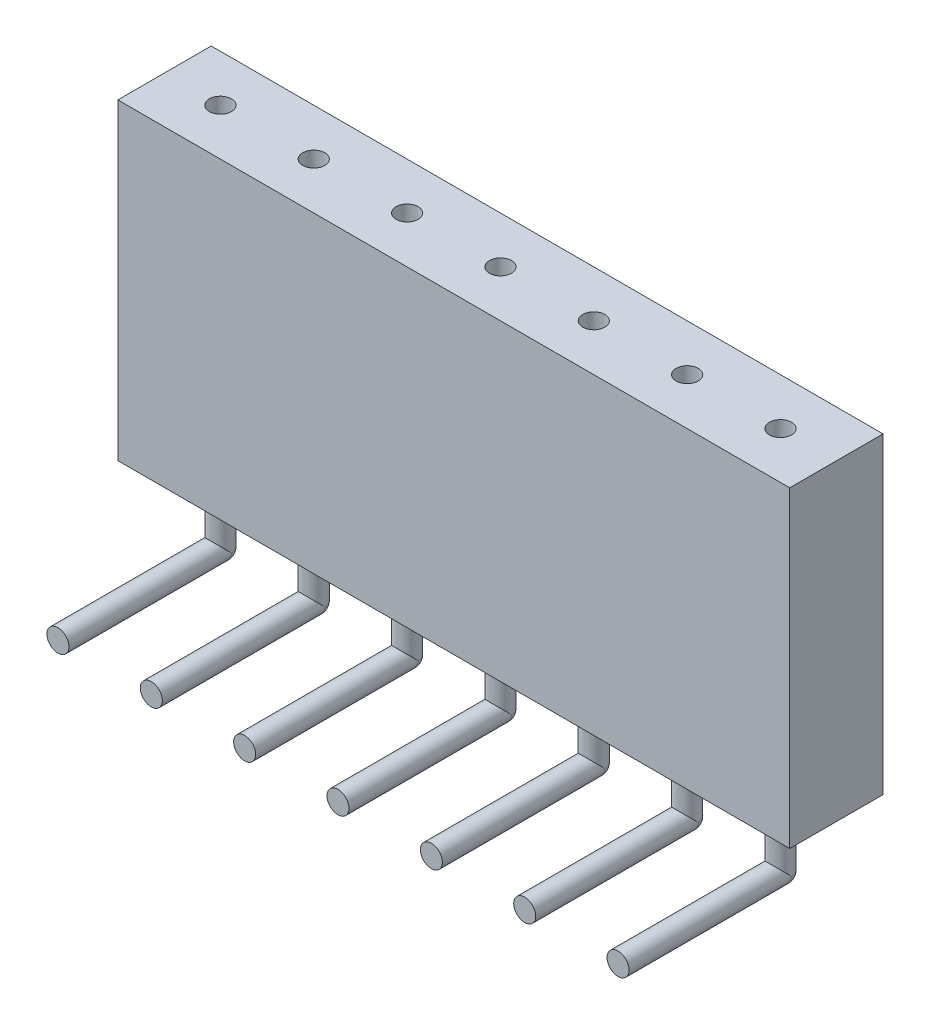
ISO-10303-21;
HEADER;
FILE_DESCRIPTION(('STEP AP214'),'2;1');
FILE_NAME('part.step','',(''),(''),'','','');
FILE_SCHEMA(('AUTOMOTIVE_DESIGN { 1 0 10303 214 1 1 1 1 }'));
ENDSEC;
DATA;
#1=APPLICATION_CONTEXT('core data for automotive mechanical design processes');
#2=APPLICATION_PROTOCOL_DEFINITION('international standard','automotive_design',2000,#1);
#3=PRODUCT_CONTEXT('',#1,'mechanical');
#4=PRODUCT('Part','Part','',(#3));
#5=PRODUCT_RELATED_PRODUCT_CATEGORY('part','',(#4));
#6=PRODUCT_DEFINITION_FORMATION('','',#4);
#7=PRODUCT_DEFINITION_CONTEXT('part definition',#1,'design');
#8=PRODUCT_DEFINITION('design','',#6,#7);
#9=PRODUCT_DEFINITION_SHAPE('','',#8);
#10=(LENGTH_UNIT() NAMED_UNIT(*) SI_UNIT(.MILLI.,.METRE.));
#11=(NAMED_UNIT(*) PLANE_ANGLE_UNIT() SI_UNIT($,.RADIAN.));
#12=(NAMED_UNIT(*) SI_UNIT($,.STERADIAN.) SOLID_ANGLE_UNIT());
#13=UNCERTAINTY_MEASURE_WITH_UNIT(LENGTH_MEASURE(1.E-05),#10,'distance_accuracy_value','');
#14=(GEOMETRIC_REPRESENTATION_CONTEXT(3) GLOBAL_UNCERTAINTY_ASSIGNED_CONTEXT((#13)) GLOBAL_UNIT_ASSIGNED_CONTEXT((#10,
#11,#12)) REPRESENTATION_CONTEXT('',''));
#15=CARTESIAN_POINT('',(0.,0.,0.));
#16=DIRECTION('',(0.,0.,1.));
#17=DIRECTION('',(1.,0.,0.));
#18=AXIS2_PLACEMENT_3D('',#15,#16,#17);
#19=CARTESIAN_POINT('',(7.61999999999998,-1.9,-0.3));
#20=DIRECTION('',(0.,0.,1.));
#21=DIRECTION('',(1.,0.,0.));
#22=AXIS2_PLACEMENT_3D('',#19,#20,#21);
#23=CYLINDRICAL_SURFACE('',#22,0.3);
#24=CARTESIAN_POINT('',(7.61999999999998,-1.9,0.));
#25=DIRECTION('',(0.,0.,1.));
#26=DIRECTION('',(1.,0.,0.));
#27=AXIS2_PLACEMENT_3D('',#24,#25,#26);
#28=CIRCLE('',#27,0.3);
#29=CARTESIAN_POINT('',(7.91999999999998,-1.9,0.));
#30=VERTEX_POINT('',#29);
#31=EDGE_CURVE('E11',#30,#30,#28,.T.);
#32=ORIENTED_EDGE('',*,*,#31,.T.);
#33=EDGE_LOOP('',(#32));
#34=FACE_BOUND('',#33,.T.);
#35=CARTESIAN_POINT('',(7.61999999999998,-1.9,4.42));
#36=DIRECTION('',(0.,0.,1.));
#37=DIRECTION('',(1.,0.,0.));
#38=AXIS2_PLACEMENT_3D('',#35,#36,#37);
#39=CIRCLE('',#38,0.3);
#40=CARTESIAN_POINT('',(7.91999999999998,-1.9,4.42));
#41=VERTEX_POINT('',#40);
#42=EDGE_CURVE('E49',#41,#41,#39,.T.);
#43=ORIENTED_EDGE('',*,*,#42,.F.);
#44=EDGE_LOOP('',(#43));
#45=FACE_BOUND('',#44,.T.);
#46=ADVANCED_FACE('F42',(#34,#45),#23,.T.);
#47=CARTESIAN_POINT('',(7.61999999999998,-1.9,4.42));
#48=DIRECTION('',(0.,0.,1.));
#49=DIRECTION('',(1.,0.,0.));
#50=AXIS2_PLACEMENT_3D('',#47,#48,#49);
#51=PLANE('',#50);
#52=ORIENTED_EDGE('',*,*,#42,.T.);
#53=EDGE_LOOP('',(#52));
#54=FACE_BOUND('',#53,.T.);
#55=ADVANCED_FACE('F55',(#54),#51,.T.);
#56=CARTESIAN_POINT('',(7.61999999999998,-1.9,0.));
#57=DIRECTION('',(0.,0.,1.));
#58=DIRECTION('',(1.,0.,0.));
#59=AXIS2_PLACEMENT_3D('',#56,#57,#58);
#60=SPHERICAL_SURFACE('',#59,0.3);
#61=ORIENTED_EDGE('',*,*,#31,.F.);
#62=EDGE_LOOP('',(#61));
#63=FACE_BOUND('',#62,.T.);
#64=ADVANCED_FACE('F44',(#63),#60,.T.);
#65=CLOSED_SHELL('',(#46,#55,#64));
#66=MANIFOLD_SOLID_BREP('B2',#65);
#67=CARTESIAN_POINT('',(5.07999999999998,-1.9,-0.3));
#68=DIRECTION('',(0.,0.,1.));
#69=DIRECTION('',(1.,0.,0.));
#70=AXIS2_PLACEMENT_3D('',#67,#68,#69);
#71=CYLINDRICAL_SURFACE('',#70,0.3);
#72=CARTESIAN_POINT('',(5.07999999999998,-1.9,0.));
#73=DIRECTION('',(0.,0.,1.));
#74=DIRECTION('',(1.,0.,0.));
#75=AXIS2_PLACEMENT_3D('',#72,#73,#74);
#76=CIRCLE('',#75,0.3);
#77=CARTESIAN_POINT('',(5.37999999999998,-1.9,0.));
#78=VERTEX_POINT('',#77);
#79=EDGE_CURVE('E41',#78,#78,#76,.T.);
#80=ORIENTED_EDGE('',*,*,#79,.T.);
#81=EDGE_LOOP('',(#80));
#82=FACE_BOUND('',#81,.T.);
#83=CARTESIAN_POINT('',(5.07999999999998,-1.9,4.42));
#84=DIRECTION('',(0.,0.,1.));
#85=DIRECTION('',(1.,0.,0.));
#86=AXIS2_PLACEMENT_3D('',#83,#84,#85);
#87=CIRCLE('',#86,0.3);
#88=CARTESIAN_POINT('',(5.37999999999998,-1.9,4.42));
#89=VERTEX_POINT('',#88);
#90=EDGE_CURVE('E98',#89,#89,#87,.T.);
#91=ORIENTED_EDGE('',*,*,#90,.F.);
#92=EDGE_LOOP('',(#91));
#93=FACE_BOUND('',#92,.T.);
#94=ADVANCED_FACE('F91',(#82,#93),#71,.T.);
#95=CARTESIAN_POINT('',(5.07999999999998,-1.9,4.42));
#96=DIRECTION('',(0.,0.,1.));
#97=DIRECTION('',(1.,0.,0.));
#98=AXIS2_PLACEMENT_3D('',#95,#96,#97);
#99=PLANE('',#98);
#100=ORIENTED_EDGE('',*,*,#90,.T.);
#101=EDGE_LOOP('',(#100));
#102=FACE_BOUND('',#101,.T.);
#103=ADVANCED_FACE('F104',(#102),#99,.T.);
#104=CARTESIAN_POINT('',(5.07999999999998,-1.9,0.));
#105=DIRECTION('',(0.,0.,1.));
#106=DIRECTION('',(1.,0.,0.));
#107=AXIS2_PLACEMENT_3D('',#104,#105,#106);
#108=SPHERICAL_SURFACE('',#107,0.3);
#109=ORIENTED_EDGE('',*,*,#79,.F.);
#110=EDGE_LOOP('',(#109));
#111=FACE_BOUND('',#110,.T.);
#112=ADVANCED_FACE('F93',(#111),#108,.T.);
#113=CLOSED_SHELL('',(#94,#103,#112));
#114=MANIFOLD_SOLID_BREP('B6',#113);
#115=CARTESIAN_POINT('',(2.53999999999998,-1.9,-0.3));
#116=DIRECTION('',(0.,0.,1.));
#117=DIRECTION('',(1.,0.,0.));
#118=AXIS2_PLACEMENT_3D('',#115,#116,#117);
#119=CYLINDRICAL_SURFACE('',#118,0.3);
#120=CARTESIAN_POINT('',(2.53999999999998,-1.9,0.));
#121=DIRECTION('',(0.,0.,1.));
#122=DIRECTION('',(1.,0.,0.));
#123=AXIS2_PLACEMENT_3D('',#120,#121,#122);
#124=CIRCLE('',#123,0.3);
#125=CARTESIAN_POINT('',(2.83999999999998,-1.9,0.));
#126=VERTEX_POINT('',#125);
#127=EDGE_CURVE('E90',#126,#126,#124,.T.);
#128=ORIENTED_EDGE('',*,*,#127,.T.);
#129=EDGE_LOOP('',(#128));
#130=FACE_BOUND('',#129,.T.);
#131=CARTESIAN_POINT('',(2.53999999999998,-1.9,4.42));
#132=DIRECTION('',(0.,0.,1.));
#133=DIRECTION('',(1.,0.,0.));
#134=AXIS2_PLACEMENT_3D('',#131,#132,#133);
#135=CIRCLE('',#134,0.3);
#136=CARTESIAN_POINT('',(2.83999999999998,-1.9,4.42));
#137=VERTEX_POINT('',#136);
#138=EDGE_CURVE('E147',#137,#137,#135,.T.);
#139=ORIENTED_EDGE('',*,*,#138,.F.);
#140=EDGE_LOOP('',(#139));
#141=FACE_BOUND('',#140,.T.);
#142=ADVANCED_FACE('F140',(#130,#141),#119,.T.);
#143=CARTESIAN_POINT('',(2.53999999999998,-1.9,4.42));
#144=DIRECTION('',(0.,0.,1.));
#145=DIRECTION('',(1.,0.,0.));
#146=AXIS2_PLACEMENT_3D('',#143,#144,#145);
#147=PLANE('',#146);
#148=ORIENTED_EDGE('',*,*,#138,.T.);
#149=EDGE_LOOP('',(#148));
#150=FACE_BOUND('',#149,.T.);
#151=ADVANCED_FACE('F153',(#150),#147,.T.);
#152=CARTESIAN_POINT('',(2.53999999999998,-1.9,0.));
#153=DIRECTION('',(0.,0.,1.));
#154=DIRECTION('',(1.,0.,0.));
#155=AXIS2_PLACEMENT_3D('',#152,#153,#154);
#156=SPHERICAL_SURFACE('',#155,0.3);
#157=ORIENTED_EDGE('',*,*,#127,.F.);
#158=EDGE_LOOP('',(#157));
#159=FACE_BOUND('',#158,.T.);
#160=ADVANCED_FACE('F142',(#159),#156,.T.);
#161=CLOSED_SHELL('',(#142,#151,#160));
#162=MANIFOLD_SOLID_BREP('B36',#161);
#163=CARTESIAN_POINT('',(0.,-1.9,-0.3));
#164=DIRECTION('',(0.,0.,1.));
#165=DIRECTION('',(1.,0.,0.));
#166=AXIS2_PLACEMENT_3D('',#163,#164,#165);
#167=CYLINDRICAL_SURFACE('',#166,0.3);
#168=CARTESIAN_POINT('',(0.,-1.9,0.));
#169=DIRECTION('',(0.,0.,1.));
#170=DIRECTION('',(1.,0.,0.));
#171=AXIS2_PLACEMENT_3D('',#168,#169,#170);
#172=CIRCLE('',#171,0.3);
#173=CARTESIAN_POINT('',(0.299999999999976,-1.9,0.));
#174=VERTEX_POINT('',#173);
#175=EDGE_CURVE('E139',#174,#174,#172,.T.);
#176=ORIENTED_EDGE('',*,*,#175,.T.);
#177=EDGE_LOOP('',(#176));
#178=FACE_BOUND('',#177,.T.);
#179=CARTESIAN_POINT('',(0.,-1.9,4.42));
#180=DIRECTION('',(0.,0.,1.));
#181=DIRECTION('',(1.,0.,0.));
#182=AXIS2_PLACEMENT_3D('',#179,#180,#181);
#183=CIRCLE('',#182,0.3);
#184=CARTESIAN_POINT('',(0.299999999999976,-1.9,4.42));
#185=VERTEX_POINT('',#184);
#186=EDGE_CURVE('E196',#185,#185,#183,.T.);
#187=ORIENTED_EDGE('',*,*,#186,.F.);
#188=EDGE_LOOP('',(#187));
#189=FACE_BOUND('',#188,.T.);
#190=ADVANCED_FACE('F189',(#178,#189),#167,.T.);
#191=CARTESIAN_POINT('',(0.,-1.9,4.42));
#192=DIRECTION('',(0.,0.,1.));
#193=DIRECTION('',(1.,0.,0.));
#194=AXIS2_PLACEMENT_3D('',#191,#192,#193);
#195=PLANE('',#194);
#196=ORIENTED_EDGE('',*,*,#186,.T.);
#197=EDGE_LOOP('',(#196));
#198=FACE_BOUND('',#197,.T.);
#199=ADVANCED_FACE('F202',(#198),#195,.T.);
#200=CARTESIAN_POINT('',(0.,-1.9,0.));
#201=DIRECTION('',(0.,0.,1.));
#202=DIRECTION('',(1.,0.,0.));
#203=AXIS2_PLACEMENT_3D('',#200,#201,#202);
#204=SPHERICAL_SURFACE('',#203,0.3);
#205=ORIENTED_EDGE('',*,*,#175,.F.);
#206=EDGE_LOOP('',(#205));
#207=FACE_BOUND('',#206,.T.);
#208=ADVANCED_FACE('F191',(#207),#204,.T.);
#209=CLOSED_SHELL('',(#190,#199,#208));
#210=MANIFOLD_SOLID_BREP('B85',#209);
#211=CARTESIAN_POINT('',(-2.54000000000002,-1.9,-0.3));
#212=DIRECTION('',(0.,0.,1.));
#213=DIRECTION('',(1.,0.,0.));
#214=AXIS2_PLACEMENT_3D('',#211,#212,#213);
#215=CYLINDRICAL_SURFACE('',#214,0.3);
#216=CARTESIAN_POINT('',(-2.54000000000002,-1.9,0.));
#217=DIRECTION('',(0.,0.,1.));
#218=DIRECTION('',(1.,0.,0.));
#219=AXIS2_PLACEMENT_3D('',#216,#217,#218);
#220=CIRCLE('',#219,0.3);
#221=CARTESIAN_POINT('',(-2.24000000000002,-1.9,0.));
#222=VERTEX_POINT('',#221);
#223=EDGE_CURVE('E188',#222,#222,#220,.T.);
#224=ORIENTED_EDGE('',*,*,#223,.T.);
#225=EDGE_LOOP('',(#224));
#226=FACE_BOUND('',#225,.T.);
#227=CARTESIAN_POINT('',(-2.54000000000002,-1.9,4.42));
#228=DIRECTION('',(0.,0.,1.));
#229=DIRECTION('',(1.,0.,0.));
#230=AXIS2_PLACEMENT_3D('',#227,#228,#229);
#231=CIRCLE('',#230,0.3);
#232=CARTESIAN_POINT('',(-2.24000000000002,-1.9,4.42));
#233=VERTEX_POINT('',#232);
#234=EDGE_CURVE('E245',#233,#233,#231,.T.);
#235=ORIENTED_EDGE('',*,*,#234,.F.);
#236=EDGE_LOOP('',(#235));
#237=FACE_BOUND('',#236,.T.);
#238=ADVANCED_FACE('F238',(#226,#237),#215,.T.);
#239=CARTESIAN_POINT('',(-2.54000000000002,-1.9,4.42));
#240=DIRECTION('',(0.,0.,1.));
#241=DIRECTION('',(1.,0.,0.));
#242=AXIS2_PLACEMENT_3D('',#239,#240,#241);
#243=PLANE('',#242);
#244=ORIENTED_EDGE('',*,*,#234,.T.);
#245=EDGE_LOOP('',(#244));
#246=FACE_BOUND('',#245,.T.);
#247=ADVANCED_FACE('F251',(#246),#243,.T.);
#248=CARTESIAN_POINT('',(-2.54000000000002,-1.9,0.));
#249=DIRECTION('',(0.,0.,1.));
#250=DIRECTION('',(1.,0.,0.));
#251=AXIS2_PLACEMENT_3D('',#248,#249,#250);
#252=SPHERICAL_SURFACE('',#251,0.3);
#253=ORIENTED_EDGE('',*,*,#223,.F.);
#254=EDGE_LOOP('',(#253));
#255=FACE_BOUND('',#254,.T.);
#256=ADVANCED_FACE('F240',(#255),#252,.T.);
#257=CLOSED_SHELL('',(#238,#247,#256));
#258=MANIFOLD_SOLID_BREP('B134',#257);
#259=CARTESIAN_POINT('',(-5.08000000000002,-1.9,-0.3));
#260=DIRECTION('',(0.,0.,1.));
#261=DIRECTION('',(1.,0.,0.));
#262=AXIS2_PLACEMENT_3D('',#259,#260,#261);
#263=CYLINDRICAL_SURFACE('',#262,0.3);
#264=CARTESIAN_POINT('',(-5.08000000000002,-1.9,0.));
#265=DIRECTION('',(0.,0.,1.));
#266=DIRECTION('',(1.,0.,0.));
#267=AXIS2_PLACEMENT_3D('',#264,#265,#266);
#268=CIRCLE('',#267,0.3);
#269=CARTESIAN_POINT('',(-4.78000000000002,-1.9,0.));
#270=VERTEX_POINT('',#269);
#271=EDGE_CURVE('E237',#270,#270,#268,.T.);
#272=ORIENTED_EDGE('',*,*,#271,.T.);
#273=EDGE_LOOP('',(#272));
#274=FACE_BOUND('',#273,.T.);
#275=CARTESIAN_POINT('',(-5.08000000000002,-1.9,4.42));
#276=DIRECTION('',(0.,0.,1.));
#277=DIRECTION('',(1.,0.,0.));
#278=AXIS2_PLACEMENT_3D('',#275,#276,#277);
#279=CIRCLE('',#278,0.3);
#280=CARTESIAN_POINT('',(-4.78000000000002,-1.9,4.42));
#281=VERTEX_POINT('',#280);
#282=EDGE_CURVE('E294',#281,#281,#279,.T.);
#283=ORIENTED_EDGE('',*,*,#282,.F.);
#284=EDGE_LOOP('',(#283));
#285=FACE_BOUND('',#284,.T.);
#286=ADVANCED_FACE('F287',(#274,#285),#263,.T.);
#287=CARTESIAN_POINT('',(-5.08000000000002,-1.9,4.42));
#288=DIRECTION('',(0.,0.,1.));
#289=DIRECTION('',(1.,0.,0.));
#290=AXIS2_PLACEMENT_3D('',#287,#288,#289);
#291=PLANE('',#290);
#292=ORIENTED_EDGE('',*,*,#282,.T.);
#293=EDGE_LOOP('',(#292));
#294=FACE_BOUND('',#293,.T.);
#295=ADVANCED_FACE('F300',(#294),#291,.T.);
#296=CARTESIAN_POINT('',(-5.08000000000002,-1.9,0.));
#297=DIRECTION('',(0.,0.,1.));
#298=DIRECTION('',(1.,0.,0.));
#299=AXIS2_PLACEMENT_3D('',#296,#297,#298);
#300=SPHERICAL_SURFACE('',#299,0.3);
#301=ORIENTED_EDGE('',*,*,#271,.F.);
#302=EDGE_LOOP('',(#301));
#303=FACE_BOUND('',#302,.T.);
#304=ADVANCED_FACE('F289',(#303),#300,.T.);
#305=CLOSED_SHELL('',(#286,#295,#304));
#306=MANIFOLD_SOLID_BREP('B183',#305);
#307=CARTESIAN_POINT('',(-7.62000000000002,-1.9,-0.3));
#308=DIRECTION('',(0.,0.,1.));
#309=DIRECTION('',(1.,0.,0.));
#310=AXIS2_PLACEMENT_3D('',#307,#308,#309);
#311=CYLINDRICAL_SURFACE('',#310,0.3);
#312=CARTESIAN_POINT('',(-7.62000000000002,-1.9,0.));
#313=DIRECTION('',(0.,0.,1.));
#314=DIRECTION('',(1.,0.,0.));
#315=AXIS2_PLACEMENT_3D('',#312,#313,#314);
#316=CIRCLE('',#315,0.3);
#317=CARTESIAN_POINT('',(-7.32000000000002,-1.9,0.));
#318=VERTEX_POINT('',#317);
#319=EDGE_CURVE('E286',#318,#318,#316,.T.);
#320=ORIENTED_EDGE('',*,*,#319,.T.);
#321=EDGE_LOOP('',(#320));
#322=FACE_BOUND('',#321,.T.);
#323=CARTESIAN_POINT('',(-7.62000000000002,-1.9,4.42));
#324=DIRECTION('',(0.,0.,1.));
#325=DIRECTION('',(1.,0.,0.));
#326=AXIS2_PLACEMENT_3D('',#323,#324,#325);
#327=CIRCLE('',#326,0.3);
#328=CARTESIAN_POINT('',(-7.32000000000002,-1.9,4.42));
#329=VERTEX_POINT('',#328);
#330=EDGE_CURVE('E343',#329,#329,#327,.T.);
#331=ORIENTED_EDGE('',*,*,#330,.F.);
#332=EDGE_LOOP('',(#331));
#333=FACE_BOUND('',#332,.T.);
#334=ADVANCED_FACE('F336',(#322,#333),#311,.T.);
#335=CARTESIAN_POINT('',(-7.62000000000002,-1.9,4.42));
#336=DIRECTION('',(0.,0.,1.));
#337=DIRECTION('',(1.,0.,0.));
#338=AXIS2_PLACEMENT_3D('',#335,#336,#337);
#339=PLANE('',#338);
#340=ORIENTED_EDGE('',*,*,#330,.T.);
#341=EDGE_LOOP('',(#340));
#342=FACE_BOUND('',#341,.T.);
#343=ADVANCED_FACE('F349',(#342),#339,.T.);
#344=CARTESIAN_POINT('',(-7.62000000000002,-1.9,0.));
#345=DIRECTION('',(0.,0.,1.));
#346=DIRECTION('',(1.,0.,0.));
#347=AXIS2_PLACEMENT_3D('',#344,#345,#346);
#348=SPHERICAL_SURFACE('',#347,0.3);
#349=ORIENTED_EDGE('',*,*,#319,.F.);
#350=EDGE_LOOP('',(#349));
#351=FACE_BOUND('',#350,.T.);
#352=ADVANCED_FACE('F338',(#351),#348,.T.);
#353=CLOSED_SHELL('',(#334,#343,#352));
#354=MANIFOLD_SOLID_BREP('B232',#353);
#355=CARTESIAN_POINT('',(7.61999999999998,-1.9,0.));
#356=DIRECTION('',(0.,1.,0.));
#357=DIRECTION('',(0.,0.,1.));
#358=AXIS2_PLACEMENT_3D('',#355,#356,#357);
#359=CYLINDRICAL_SURFACE('',#358,0.3);
#360=CARTESIAN_POINT('',(7.61999999999998,-1.9,0.));
#361=DIRECTION('',(0.,-1.,0.));
#362=DIRECTION('',(0.,0.,-1.));
#363=AXIS2_PLACEMENT_3D('',#360,#361,#362);
#364=CIRCLE('',#363,0.3);
#365=CARTESIAN_POINT('',(7.61999999999998,-1.9,-0.3));
#366=VERTEX_POINT('',#365);
#367=EDGE_CURVE('E335',#366,#366,#364,.T.);
#368=ORIENTED_EDGE('',*,*,#367,.F.);
#369=EDGE_LOOP('',(#368));
#370=FACE_BOUND('',#369,.T.);
#371=CARTESIAN_POINT('',(7.61999999999998,0.,0.));
#372=DIRECTION('',(0.,-1.,0.));
#373=DIRECTION('',(0.,0.,-1.));
#374=AXIS2_PLACEMENT_3D('',#371,#372,#373);
#375=CIRCLE('',#374,0.3);
#376=CARTESIAN_POINT('',(7.61999999999998,0.,-0.3));
#377=VERTEX_POINT('',#376);
#378=EDGE_CURVE('E388',#377,#377,#375,.T.);
#379=ORIENTED_EDGE('',*,*,#378,.T.);
#380=EDGE_LOOP('',(#379));
#381=FACE_BOUND('',#380,.T.);
#382=ADVANCED_FACE('F385',(#370,#381),#359,.T.);
#383=CARTESIAN_POINT('',(7.61999999999998,-1.9,0.));
#384=DIRECTION('',(0.,-1.,0.));
#385=DIRECTION('',(0.,0.,-1.));
#386=AXIS2_PLACEMENT_3D('',#383,#384,#385);
#387=PLANE('',#386);
#388=ORIENTED_EDGE('',*,*,#367,.T.);
#389=EDGE_LOOP('',(#388));
#390=FACE_BOUND('',#389,.T.);
#391=ADVANCED_FACE('F400',(#390),#387,.T.);
#392=CARTESIAN_POINT('',(7.61999999999998,0.,0.));
#393=DIRECTION('',(0.,-1.,0.));
#394=DIRECTION('',(0.,0.,-1.));
#395=AXIS2_PLACEMENT_3D('',#392,#393,#394);
#396=PLANE('',#395);
#397=ORIENTED_EDGE('',*,*,#378,.F.);
#398=EDGE_LOOP('',(#397));
#399=FACE_BOUND('',#398,.T.);
#400=ADVANCED_FACE('F398',(#399),#396,.F.);
#401=CLOSED_SHELL('',(#382,#391,#400));
#402=MANIFOLD_SOLID_BREP('B281',#401);
#403=CARTESIAN_POINT('',(5.07999999999998,-1.9,0.));
#404=DIRECTION('',(0.,1.,0.));
#405=DIRECTION('',(0.,0.,1.));
#406=AXIS2_PLACEMENT_3D('',#403,#404,#405);
#407=CYLINDRICAL_SURFACE('',#406,0.3);
#408=CARTESIAN_POINT('',(5.07999999999998,-1.9,0.));
#409=DIRECTION('',(0.,-1.,0.));
#410=DIRECTION('',(0.,0.,-1.));
#411=AXIS2_PLACEMENT_3D('',#408,#409,#410);
#412=CIRCLE('',#411,0.3);
#413=CARTESIAN_POINT('',(5.07999999999998,-1.9,-0.3));
#414=VERTEX_POINT('',#413);
#415=EDGE_CURVE('E384',#414,#414,#412,.T.);
#416=ORIENTED_EDGE('',*,*,#415,.F.);
#417=EDGE_LOOP('',(#416));
#418=FACE_BOUND('',#417,.T.);
#419=CARTESIAN_POINT('',(5.07999999999998,0.,0.));
#420=DIRECTION('',(0.,-1.,0.));
#421=DIRECTION('',(0.,0.,-1.));
#422=AXIS2_PLACEMENT_3D('',#419,#420,#421);
#423=CIRCLE('',#422,0.3);
#424=CARTESIAN_POINT('',(5.07999999999998,0.,-0.3));
#425=VERTEX_POINT('',#424);
#426=EDGE_CURVE('E437',#425,#425,#423,.T.);
#427=ORIENTED_EDGE('',*,*,#426,.T.);
#428=EDGE_LOOP('',(#427));
#429=FACE_BOUND('',#428,.T.);
#430=ADVANCED_FACE('F434',(#418,#429),#407,.T.);
#431=CARTESIAN_POINT('',(5.07999999999998,-1.9,0.));
#432=DIRECTION('',(0.,-1.,0.));
#433=DIRECTION('',(0.,0.,-1.));
#434=AXIS2_PLACEMENT_3D('',#431,#432,#433);
#435=PLANE('',#434);
#436=ORIENTED_EDGE('',*,*,#415,.T.);
#437=EDGE_LOOP('',(#436));
#438=FACE_BOUND('',#437,.T.);
#439=ADVANCED_FACE('F449',(#438),#435,.T.);
#440=CARTESIAN_POINT('',(5.07999999999998,0.,0.));
#441=DIRECTION('',(0.,-1.,0.));
#442=DIRECTION('',(0.,0.,-1.));
#443=AXIS2_PLACEMENT_3D('',#440,#441,#442);
#444=PLANE('',#443);
#445=ORIENTED_EDGE('',*,*,#426,.F.);
#446=EDGE_LOOP('',(#445));
#447=FACE_BOUND('',#446,.T.);
#448=ADVANCED_FACE('F447',(#447),#444,.F.);
#449=CLOSED_SHELL('',(#430,#439,#448));
#450=MANIFOLD_SOLID_BREP('B330',#449);
#451=CARTESIAN_POINT('',(2.53999999999998,-1.9,0.));
#452=DIRECTION('',(0.,1.,0.));
#453=DIRECTION('',(0.,0.,1.));
#454=AXIS2_PLACEMENT_3D('',#451,#452,#453);
#455=CYLINDRICAL_SURFACE('',#454,0.3);
#456=CARTESIAN_POINT('',(2.53999999999998,-1.9,0.));
#457=DIRECTION('',(0.,-1.,0.));
#458=DIRECTION('',(0.,0.,-1.));
#459=AXIS2_PLACEMENT_3D('',#456,#457,#458);
#460=CIRCLE('',#459,0.3);
#461=CARTESIAN_POINT('',(2.53999999999998,-1.9,-0.3));
#462=VERTEX_POINT('',#461);
#463=EDGE_CURVE('E433',#462,#462,#460,.T.);
#464=ORIENTED_EDGE('',*,*,#463,.F.);
#465=EDGE_LOOP('',(#464));
#466=FACE_BOUND('',#465,.T.);
#467=CARTESIAN_POINT('',(2.53999999999998,0.,0.));
#468=DIRECTION('',(0.,-1.,0.));
#469=DIRECTION('',(0.,0.,-1.));
#470=AXIS2_PLACEMENT_3D('',#467,#468,#469);
#471=CIRCLE('',#470,0.3);
#472=CARTESIAN_POINT('',(2.53999999999998,0.,-0.3));
#473=VERTEX_POINT('',#472);
#474=EDGE_CURVE('E486',#473,#473,#471,.T.);
#475=ORIENTED_EDGE('',*,*,#474,.T.);
#476=EDGE_LOOP('',(#475));
#477=FACE_BOUND('',#476,.T.);
#478=ADVANCED_FACE('F483',(#466,#477),#455,.T.);
#479=CARTESIAN_POINT('',(2.53999999999998,-1.9,0.));
#480=DIRECTION('',(0.,-1.,0.));
#481=DIRECTION('',(0.,0.,-1.));
#482=AXIS2_PLACEMENT_3D('',#479,#480,#481);
#483=PLANE('',#482);
#484=ORIENTED_EDGE('',*,*,#463,.T.);
#485=EDGE_LOOP('',(#484));
#486=FACE_BOUND('',#485,.T.);
#487=ADVANCED_FACE('F498',(#486),#483,.T.);
#488=CARTESIAN_POINT('',(2.53999999999998,0.,0.));
#489=DIRECTION('',(0.,-1.,0.));
#490=DIRECTION('',(0.,0.,-1.));
#491=AXIS2_PLACEMENT_3D('',#488,#489,#490);
#492=PLANE('',#491);
#493=ORIENTED_EDGE('',*,*,#474,.F.);
#494=EDGE_LOOP('',(#493));
#495=FACE_BOUND('',#494,.T.);
#496=ADVANCED_FACE('F496',(#495),#492,.F.);
#497=CLOSED_SHELL('',(#478,#487,#496));
#498=MANIFOLD_SOLID_BREP('B379',#497);
#499=CARTESIAN_POINT('',(0.,-1.9,0.));
#500=DIRECTION('',(0.,1.,0.));
#501=DIRECTION('',(0.,0.,1.));
#502=AXIS2_PLACEMENT_3D('',#499,#500,#501);
#503=CYLINDRICAL_SURFACE('',#502,0.3);
#504=CARTESIAN_POINT('',(0.,-1.9,0.));
#505=DIRECTION('',(0.,-1.,0.));
#506=DIRECTION('',(0.,0.,-1.));
#507=AXIS2_PLACEMENT_3D('',#504,#505,#506);
#508=CIRCLE('',#507,0.3);
#509=CARTESIAN_POINT('',(0.,-1.9,-0.3));
#510=VERTEX_POINT('',#509);
#511=EDGE_CURVE('E482',#510,#510,#508,.T.);
#512=ORIENTED_EDGE('',*,*,#511,.F.);
#513=EDGE_LOOP('',(#512));
#514=FACE_BOUND('',#513,.T.);
#515=CARTESIAN_POINT('',(0.,0.,0.));
#516=DIRECTION('',(0.,-1.,0.));
#517=DIRECTION('',(0.,0.,-1.));
#518=AXIS2_PLACEMENT_3D('',#515,#516,#517);
#519=CIRCLE('',#518,0.3);
#520=CARTESIAN_POINT('',(0.,0.,-0.3));
#521=VERTEX_POINT('',#520);
#522=EDGE_CURVE('E535',#521,#521,#519,.T.);
#523=ORIENTED_EDGE('',*,*,#522,.T.);
#524=EDGE_LOOP('',(#523));
#525=FACE_BOUND('',#524,.T.);
#526=ADVANCED_FACE('F532',(#514,#525),#503,.T.);
#527=CARTESIAN_POINT('',(0.,-1.9,0.));
#528=DIRECTION('',(0.,-1.,0.));
#529=DIRECTION('',(0.,0.,-1.));
#530=AXIS2_PLACEMENT_3D('',#527,#528,#529);
#531=PLANE('',#530);
#532=ORIENTED_EDGE('',*,*,#511,.T.);
#533=EDGE_LOOP('',(#532));
#534=FACE_BOUND('',#533,.T.);
#535=ADVANCED_FACE('F547',(#534),#531,.T.);
#536=CARTESIAN_POINT('',(0.,0.,0.));
#537=DIRECTION('',(0.,-1.,0.));
#538=DIRECTION('',(0.,0.,-1.));
#539=AXIS2_PLACEMENT_3D('',#536,#537,#538);
#540=PLANE('',#539);
#541=ORIENTED_EDGE('',*,*,#522,.F.);
#542=EDGE_LOOP('',(#541));
#543=FACE_BOUND('',#542,.T.);
#544=ADVANCED_FACE('F545',(#543),#540,.F.);
#545=CLOSED_SHELL('',(#526,#535,#544));
#546=MANIFOLD_SOLID_BREP('B428',#545);
#547=CARTESIAN_POINT('',(-2.54000000000002,-1.9,0.));
#548=DIRECTION('',(0.,1.,0.));
#549=DIRECTION('',(0.,0.,1.));
#550=AXIS2_PLACEMENT_3D('',#547,#548,#549);
#551=CYLINDRICAL_SURFACE('',#550,0.3);
#552=CARTESIAN_POINT('',(-2.54000000000002,-1.9,0.));
#553=DIRECTION('',(0.,-1.,0.));
#554=DIRECTION('',(0.,0.,-1.));
#555=AXIS2_PLACEMENT_3D('',#552,#553,#554);
#556=CIRCLE('',#555,0.3);
#557=CARTESIAN_POINT('',(-2.54000000000002,-1.9,-0.3));
#558=VERTEX_POINT('',#557);
#559=EDGE_CURVE('E531',#558,#558,#556,.T.);
#560=ORIENTED_EDGE('',*,*,#559,.F.);
#561=EDGE_LOOP('',(#560));
#562=FACE_BOUND('',#561,.T.);
#563=CARTESIAN_POINT('',(-2.54000000000002,0.,0.));
#564=DIRECTION('',(0.,-1.,0.));
#565=DIRECTION('',(0.,0.,-1.));
#566=AXIS2_PLACEMENT_3D('',#563,#564,#565);
#567=CIRCLE('',#566,0.3);
#568=CARTESIAN_POINT('',(-2.54000000000002,0.,-0.3));
#569=VERTEX_POINT('',#568);
#570=EDGE_CURVE('E584',#569,#569,#567,.T.);
#571=ORIENTED_EDGE('',*,*,#570,.T.);
#572=EDGE_LOOP('',(#571));
#573=FACE_BOUND('',#572,.T.);
#574=ADVANCED_FACE('F581',(#562,#573),#551,.T.);
#575=CARTESIAN_POINT('',(-2.54000000000002,-1.9,0.));
#576=DIRECTION('',(0.,-1.,0.));
#577=DIRECTION('',(0.,0.,-1.));
#578=AXIS2_PLACEMENT_3D('',#575,#576,#577);
#579=PLANE('',#578);
#580=ORIENTED_EDGE('',*,*,#559,.T.);
#581=EDGE_LOOP('',(#580));
#582=FACE_BOUND('',#581,.T.);
#583=ADVANCED_FACE('F596',(#582),#579,.T.);
#584=CARTESIAN_POINT('',(-2.54000000000002,0.,0.));
#585=DIRECTION('',(0.,-1.,0.));
#586=DIRECTION('',(0.,0.,-1.));
#587=AXIS2_PLACEMENT_3D('',#584,#585,#586);
#588=PLANE('',#587);
#589=ORIENTED_EDGE('',*,*,#570,.F.);
#590=EDGE_LOOP('',(#589));
#591=FACE_BOUND('',#590,.T.);
#592=ADVANCED_FACE('F594',(#591),#588,.F.);
#593=CLOSED_SHELL('',(#574,#583,#592));
#594=MANIFOLD_SOLID_BREP('B477',#593);
#595=CARTESIAN_POINT('',(-7.62000000000002,-1.9,0.));
#596=DIRECTION('',(0.,1.,0.));
#597=DIRECTION('',(0.,0.,1.));
#598=AXIS2_PLACEMENT_3D('',#595,#596,#597);
#599=CYLINDRICAL_SURFACE('',#598,0.3);
#600=CARTESIAN_POINT('',(-7.62000000000002,-1.9,0.));
#601=DIRECTION('',(0.,-1.,0.));
#602=DIRECTION('',(0.,0.,-1.));
#603=AXIS2_PLACEMENT_3D('',#600,#601,#602);
#604=CIRCLE('',#603,0.3);
#605=CARTESIAN_POINT('',(-7.62000000000002,-1.9,-0.3));
#606=VERTEX_POINT('',#605);
#607=EDGE_CURVE('E580',#606,#606,#604,.T.);
#608=ORIENTED_EDGE('',*,*,#607,.F.);
#609=EDGE_LOOP('',(#608));
#610=FACE_BOUND('',#609,.T.);
#611=CARTESIAN_POINT('',(-7.62000000000002,0.,0.));
#612=DIRECTION('',(0.,-1.,0.));
#613=DIRECTION('',(0.,0.,-1.));
#614=AXIS2_PLACEMENT_3D('',#611,#612,#613);
#615=CIRCLE('',#614,0.3);
#616=CARTESIAN_POINT('',(-7.62000000000002,0.,-0.3));
#617=VERTEX_POINT('',#616);
#618=EDGE_CURVE('E633',#617,#617,#615,.T.);
#619=ORIENTED_EDGE('',*,*,#618,.T.);
#620=EDGE_LOOP('',(#619));
#621=FACE_BOUND('',#620,.T.);
#622=ADVANCED_FACE('F630',(#610,#621),#599,.T.);
#623=CARTESIAN_POINT('',(-7.62000000000002,-1.9,0.));
#624=DIRECTION('',(0.,-1.,0.));
#625=DIRECTION('',(0.,0.,-1.));
#626=AXIS2_PLACEMENT_3D('',#623,#624,#625);
#627=PLANE('',#626);
#628=ORIENTED_EDGE('',*,*,#607,.T.);
#629=EDGE_LOOP('',(#628));
#630=FACE_BOUND('',#629,.T.);
#631=ADVANCED_FACE('F645',(#630),#627,.T.);
#632=CARTESIAN_POINT('',(-7.62000000000002,0.,0.));
#633=DIRECTION('',(0.,-1.,0.));
#634=DIRECTION('',(0.,0.,-1.));
#635=AXIS2_PLACEMENT_3D('',#632,#633,#634);
#636=PLANE('',#635);
#637=ORIENTED_EDGE('',*,*,#618,.F.);
#638=EDGE_LOOP('',(#637));
#639=FACE_BOUND('',#638,.T.);
#640=ADVANCED_FACE('F643',(#639),#636,.F.);
#641=CLOSED_SHELL('',(#622,#631,#640));
#642=MANIFOLD_SOLID_BREP('B526',#641);
#643=CARTESIAN_POINT('',(-5.08000000000002,-1.9,0.));
#644=DIRECTION('',(0.,1.,0.));
#645=DIRECTION('',(0.,0.,1.));
#646=AXIS2_PLACEMENT_3D('',#643,#644,#645);
#647=CYLINDRICAL_SURFACE('',#646,0.3);
#648=CARTESIAN_POINT('',(-5.08000000000002,-1.9,0.));
#649=DIRECTION('',(0.,-1.,0.));
#650=DIRECTION('',(0.,0.,-1.));
#651=AXIS2_PLACEMENT_3D('',#648,#649,#650);
#652=CIRCLE('',#651,0.3);
#653=CARTESIAN_POINT('',(-5.08000000000002,-1.9,-0.3));
#654=VERTEX_POINT('',#653);
#655=EDGE_CURVE('E629',#654,#654,#652,.T.);
#656=ORIENTED_EDGE('',*,*,#655,.F.);
#657=EDGE_LOOP('',(#656));
#658=FACE_BOUND('',#657,.T.);
#659=CARTESIAN_POINT('',(-5.08000000000002,0.,0.));
#660=DIRECTION('',(0.,-1.,0.));
#661=DIRECTION('',(0.,0.,-1.));
#662=AXIS2_PLACEMENT_3D('',#659,#660,#661);
#663=CIRCLE('',#662,0.3);
#664=CARTESIAN_POINT('',(-5.08000000000002,0.,-0.3));
#665=VERTEX_POINT('',#664);
#666=EDGE_CURVE('E683',#665,#665,#663,.T.);
#667=ORIENTED_EDGE('',*,*,#666,.T.);
#668=EDGE_LOOP('',(#667));
#669=FACE_BOUND('',#668,.T.);
#670=ADVANCED_FACE('F680',(#658,#669),#647,.T.);
#671=CARTESIAN_POINT('',(-5.08000000000002,-1.9,0.));
#672=DIRECTION('',(0.,-1.,0.));
#673=DIRECTION('',(0.,0.,-1.));
#674=AXIS2_PLACEMENT_3D('',#671,#672,#673);
#675=PLANE('',#674);
#676=ORIENTED_EDGE('',*,*,#655,.T.);
#677=EDGE_LOOP('',(#676));
#678=FACE_BOUND('',#677,.T.);
#679=ADVANCED_FACE('F695',(#678),#675,.T.);
#680=CARTESIAN_POINT('',(-5.08000000000002,0.,0.));
#681=DIRECTION('',(0.,-1.,0.));
#682=DIRECTION('',(0.,0.,-1.));
#683=AXIS2_PLACEMENT_3D('',#680,#681,#682);
#684=PLANE('',#683);
#685=ORIENTED_EDGE('',*,*,#666,.F.);
#686=EDGE_LOOP('',(#685));
#687=FACE_BOUND('',#686,.T.);
#688=ADVANCED_FACE('F693',(#687),#684,.F.);
#689=CLOSED_SHELL('',(#670,#679,#688));
#690=MANIFOLD_SOLID_BREP('B575',#689);
#691=CARTESIAN_POINT('',(9.14,8.5,-1.27));
#692=DIRECTION('',(-1.,0.,0.));
#693=DIRECTION('',(0.,0.,1.));
#694=AXIS2_PLACEMENT_3D('',#691,#692,#693);
#695=PLANE('',#694);
#696=DIRECTION('',(0.,0.,-1.));
#697=VECTOR('',#696,1.);
#698=CARTESIAN_POINT('',(9.14,0.,-1.27));
#699=LINE('',#698,#697);
#700=CARTESIAN_POINT('',(9.14,0.,1.27));
#701=VERTEX_POINT('',#700);
#702=CARTESIAN_POINT('',(9.14,0.,-1.27));
#703=VERTEX_POINT('',#702);
#704=EDGE_CURVE('E784',#701,#703,#699,.T.);
#705=ORIENTED_EDGE('',*,*,#704,.T.);
#706=DIRECTION('',(0.,-1.,0.));
#707=VECTOR('',#706,1.);
#708=CARTESIAN_POINT('',(9.14,8.5,-1.27));
#709=LINE('',#708,#707);
#710=CARTESIAN_POINT('',(9.14,8.5,-1.27));
#711=VERTEX_POINT('',#710);
#712=EDGE_CURVE('E678',#711,#703,#709,.T.);
#713=ORIENTED_EDGE('',*,*,#712,.F.);
#714=DIRECTION('',(0.,0.,-1.));
#715=VECTOR('',#714,1.);
#716=CARTESIAN_POINT('',(9.14,8.5,-1.27));
#717=LINE('',#716,#715);
#718=CARTESIAN_POINT('',(9.14,8.5,1.27));
#719=VERTEX_POINT('',#718);
#720=EDGE_CURVE('E772',#719,#711,#717,.T.);
#721=ORIENTED_EDGE('',*,*,#720,.F.);
#722=DIRECTION('',(0.,-1.,0.));
#723=VECTOR('',#722,1.);
#724=CARTESIAN_POINT('',(9.14,8.5,1.27));
#725=LINE('',#724,#723);
#726=EDGE_CURVE('E780',#719,#701,#725,.T.);
#727=ORIENTED_EDGE('',*,*,#726,.T.);
#728=EDGE_LOOP('',(#705,#713,#721,#727));
#729=FACE_BOUND('',#728,.T.);
#730=ADVANCED_FACE('F721',(#729),#695,.F.);
#731=CARTESIAN_POINT('',(-9.14,8.5,-1.27));
#732=DIRECTION('',(0.,0.,1.));
#733=DIRECTION('',(1.,0.,0.));
#734=AXIS2_PLACEMENT_3D('',#731,#732,#733);
#735=PLANE('',#734);
#736=DIRECTION('',(-1.,0.,0.));
#737=VECTOR('',#736,1.);
#738=CARTESIAN_POINT('',(-9.14,0.,-1.27));
#739=LINE('',#738,#737);
#740=CARTESIAN_POINT('',(-9.14,0.,-1.27));
#741=VERTEX_POINT('',#740);
#742=EDGE_CURVE('E776',#703,#741,#739,.T.);
#743=ORIENTED_EDGE('',*,*,#742,.T.);
#744=DIRECTION('',(0.,-1.,0.));
#745=VECTOR('',#744,1.);
#746=CARTESIAN_POINT('',(-9.14,8.5,-1.27));
#747=LINE('',#746,#745);
#748=CARTESIAN_POINT('',(-9.14,8.5,-1.27));
#749=VERTEX_POINT('',#748);
#750=EDGE_CURVE('E729',#749,#741,#747,.T.);
#751=ORIENTED_EDGE('',*,*,#750,.F.);
#752=DIRECTION('',(-1.,0.,0.));
#753=VECTOR('',#752,1.);
#754=CARTESIAN_POINT('',(-9.14,8.5,-1.27));
#755=LINE('',#754,#753);
#756=EDGE_CURVE('E767',#711,#749,#755,.T.);
#757=ORIENTED_EDGE('',*,*,#756,.F.);
#758=ORIENTED_EDGE('',*,*,#712,.T.);
#759=EDGE_LOOP('',(#743,#751,#757,#758));
#760=FACE_BOUND('',#759,.T.);
#761=ADVANCED_FACE('F775',(#760),#735,.F.);
#762=CARTESIAN_POINT('',(-9.14,8.5,-1.27));
#763=DIRECTION('',(1.,0.,0.));
#764=DIRECTION('',(0.,0.,-1.));
#765=AXIS2_PLACEMENT_3D('',#762,#763,#764);
#766=PLANE('',#765);
#767=DIRECTION('',(0.,0.,1.));
#768=VECTOR('',#767,1.);
#769=CARTESIAN_POINT('',(-9.14,0.,-1.27));
#770=LINE('',#769,#768);
#771=CARTESIAN_POINT('',(-9.14,0.,1.27));
#772=VERTEX_POINT('',#771);
#773=EDGE_CURVE('E754',#741,#772,#770,.T.);
#774=ORIENTED_EDGE('',*,*,#773,.T.);
#775=DIRECTION('',(0.,-1.,0.));
#776=VECTOR('',#775,1.);
#777=CARTESIAN_POINT('',(-9.14,8.5,1.27));
#778=LINE('',#777,#776);
#779=CARTESIAN_POINT('',(-9.14,8.5,1.27));
#780=VERTEX_POINT('',#779);
#781=EDGE_CURVE('E777',#780,#772,#778,.T.);
#782=ORIENTED_EDGE('',*,*,#781,.F.);
#783=DIRECTION('',(0.,0.,1.));
#784=VECTOR('',#783,1.);
#785=CARTESIAN_POINT('',(-9.14,8.5,-1.27));
#786=LINE('',#785,#784);
#787=EDGE_CURVE('E770',#749,#780,#786,.T.);
#788=ORIENTED_EDGE('',*,*,#787,.F.);
#789=ORIENTED_EDGE('',*,*,#750,.T.);
#790=EDGE_LOOP('',(#774,#782,#788,#789));
#791=FACE_BOUND('',#790,.T.);
#792=ADVANCED_FACE('F778',(#791),#766,.F.);
#793=CARTESIAN_POINT('',(-9.14,8.5,1.27));
#794=DIRECTION('',(0.,0.,-1.));
#795=DIRECTION('',(-1.,0.,0.));
#796=AXIS2_PLACEMENT_3D('',#793,#794,#795);
#797=PLANE('',#796);
#798=DIRECTION('',(1.,0.,0.));
#799=VECTOR('',#798,1.);
#800=CARTESIAN_POINT('',(-9.14,0.,1.27));
#801=LINE('',#800,#799);
#802=EDGE_CURVE('E760',#772,#701,#801,.T.);
#803=ORIENTED_EDGE('',*,*,#802,.T.);
#804=ORIENTED_EDGE('',*,*,#726,.F.);
#805=DIRECTION('',(1.,0.,0.));
#806=VECTOR('',#805,1.);
#807=CARTESIAN_POINT('',(-9.14,8.5,1.27));
#808=LINE('',#807,#806);
#809=EDGE_CURVE('E737',#780,#719,#808,.T.);
#810=ORIENTED_EDGE('',*,*,#809,.F.);
#811=ORIENTED_EDGE('',*,*,#781,.T.);
#812=EDGE_LOOP('',(#803,#804,#810,#811));
#813=FACE_BOUND('',#812,.T.);
#814=ADVANCED_FACE('F792',(#813),#797,.F.);
#815=CARTESIAN_POINT('',(0.,8.5,0.));
#816=DIRECTION('',(0.,1.,0.));
#817=DIRECTION('',(0.,0.,1.));
#818=AXIS2_PLACEMENT_3D('',#815,#816,#817);
#819=PLANE('',#818);
#820=CARTESIAN_POINT('',(7.61999999999998,8.5,0.));
#821=DIRECTION('',(0.,1.,0.));
#822=DIRECTION('',(0.,0.,1.));
#823=AXIS2_PLACEMENT_3D('',#820,#821,#822);
#824=CIRCLE('',#823,0.3);
#825=CARTESIAN_POINT('',(7.61999999999998,8.5,0.3));
#826=VERTEX_POINT('',#825);
#827=EDGE_CURVE('E834',#826,#826,#824,.T.);
#828=ORIENTED_EDGE('',*,*,#827,.F.);
#829=EDGE_LOOP('',(#828));
#830=FACE_BOUND('',#829,.T.);
#831=CARTESIAN_POINT('',(5.07999999999998,8.5,0.));
#832=DIRECTION('',(0.,1.,0.));
#833=DIRECTION('',(0.,0.,1.));
#834=AXIS2_PLACEMENT_3D('',#831,#832,#833);
#835=CIRCLE('',#834,0.3);
#836=CARTESIAN_POINT('',(5.07999999999998,8.5,0.3));
#837=VERTEX_POINT('',#836);
#838=EDGE_CURVE('E828',#837,#837,#835,.T.);
#839=ORIENTED_EDGE('',*,*,#838,.F.);
#840=EDGE_LOOP('',(#839));
#841=FACE_BOUND('',#840,.T.);
#842=CARTESIAN_POINT('',(2.53999999999998,8.5,0.));
#843=DIRECTION('',(0.,1.,0.));
#844=DIRECTION('',(0.,0.,1.));
#845=AXIS2_PLACEMENT_3D('',#842,#843,#844);
#846=CIRCLE('',#845,0.3);
#847=CARTESIAN_POINT('',(2.53999999999998,8.5,0.3));
#848=VERTEX_POINT('',#847);
#849=EDGE_CURVE('E822',#848,#848,#846,.T.);
#850=ORIENTED_EDGE('',*,*,#849,.F.);
#851=EDGE_LOOP('',(#850));
#852=FACE_BOUND('',#851,.T.);
#853=CARTESIAN_POINT('',(0.,8.5,0.));
#854=DIRECTION('',(0.,1.,0.));
#855=DIRECTION('',(0.,0.,1.));
#856=AXIS2_PLACEMENT_3D('',#853,#854,#855);
#857=CIRCLE('',#856,0.3);
#858=CARTESIAN_POINT('',(0.,8.5,0.3));
#859=VERTEX_POINT('',#858);
#860=EDGE_CURVE('E816',#859,#859,#857,.T.);
#861=ORIENTED_EDGE('',*,*,#860,.F.);
#862=EDGE_LOOP('',(#861));
#863=FACE_BOUND('',#862,.T.);
#864=CARTESIAN_POINT('',(-2.54000000000002,8.5,0.));
#865=DIRECTION('',(0.,1.,0.));
#866=DIRECTION('',(0.,0.,1.));
#867=AXIS2_PLACEMENT_3D('',#864,#865,#866);
#868=CIRCLE('',#867,0.3);
#869=CARTESIAN_POINT('',(-2.54000000000002,8.5,0.3));
#870=VERTEX_POINT('',#869);
#871=EDGE_CURVE('E810',#870,#870,#868,.T.);
#872=ORIENTED_EDGE('',*,*,#871,.F.);
#873=EDGE_LOOP('',(#872));
#874=FACE_BOUND('',#873,.T.);
#875=CARTESIAN_POINT('',(-7.62000000000002,8.5,0.));
#876=DIRECTION('',(0.,1.,0.));
#877=DIRECTION('',(0.,0.,1.));
#878=AXIS2_PLACEMENT_3D('',#875,#876,#877);
#879=CIRCLE('',#878,0.3);
#880=CARTESIAN_POINT('',(-7.62000000000002,8.5,0.3));
#881=VERTEX_POINT('',#880);
#882=EDGE_CURVE('E804',#881,#881,#879,.T.);
#883=ORIENTED_EDGE('',*,*,#882,.F.);
#884=EDGE_LOOP('',(#883));
#885=FACE_BOUND('',#884,.T.);
#886=CARTESIAN_POINT('',(-5.08000000000002,8.5,0.));
#887=DIRECTION('',(0.,1.,0.));
#888=DIRECTION('',(0.,0.,1.));
#889=AXIS2_PLACEMENT_3D('',#886,#887,#888);
#890=CIRCLE('',#889,0.3);
#891=CARTESIAN_POINT('',(-5.08000000000002,8.5,0.3));
#892=VERTEX_POINT('',#891);
#893=EDGE_CURVE('E798',#892,#892,#890,.T.);
#894=ORIENTED_EDGE('',*,*,#893,.F.);
#895=EDGE_LOOP('',(#894));
#896=FACE_BOUND('',#895,.T.);
#897=ORIENTED_EDGE('',*,*,#720,.T.);
#898=ORIENTED_EDGE('',*,*,#756,.T.);
#899=ORIENTED_EDGE('',*,*,#787,.T.);
#900=ORIENTED_EDGE('',*,*,#809,.T.);
#901=EDGE_LOOP('',(#897,#898,#899,#900));
#902=FACE_BOUND('',#901,.T.);
#903=ADVANCED_FACE('F768',(#830,#841,#852,#863,#874,#885,#896,#902),#819,.T.);
#904=CARTESIAN_POINT('',(0.,0.,0.));
#905=DIRECTION('',(0.,1.,0.));
#906=DIRECTION('',(0.,0.,1.));
#907=AXIS2_PLACEMENT_3D('',#904,#905,#906);
#908=PLANE('',#907);
#909=CARTESIAN_POINT('',(7.61999999999998,0.,0.));
#910=DIRECTION('',(0.,1.,0.));
#911=DIRECTION('',(0.,0.,1.));
#912=AXIS2_PLACEMENT_3D('',#909,#910,#911);
#913=CIRCLE('',#912,0.3);
#914=CARTESIAN_POINT('',(7.61999999999998,0.,0.3));
#915=VERTEX_POINT('',#914);
#916=EDGE_CURVE('E831',#915,#915,#913,.T.);
#917=ORIENTED_EDGE('',*,*,#916,.T.);
#918=EDGE_LOOP('',(#917));
#919=FACE_BOUND('',#918,.T.);
#920=CARTESIAN_POINT('',(5.07999999999998,0.,0.));
#921=DIRECTION('',(0.,1.,0.));
#922=DIRECTION('',(0.,0.,1.));
#923=AXIS2_PLACEMENT_3D('',#920,#921,#922);
#924=CIRCLE('',#923,0.3);
#925=CARTESIAN_POINT('',(5.07999999999998,0.,0.3));
#926=VERTEX_POINT('',#925);
#927=EDGE_CURVE('E825',#926,#926,#924,.T.);
#928=ORIENTED_EDGE('',*,*,#927,.T.);
#929=EDGE_LOOP('',(#928));
#930=FACE_BOUND('',#929,.T.);
#931=CARTESIAN_POINT('',(2.53999999999998,0.,0.));
#932=DIRECTION('',(0.,1.,0.));
#933=DIRECTION('',(0.,0.,1.));
#934=AXIS2_PLACEMENT_3D('',#931,#932,#933);
#935=CIRCLE('',#934,0.3);
#936=CARTESIAN_POINT('',(2.53999999999998,0.,0.3));
#937=VERTEX_POINT('',#936);
#938=EDGE_CURVE('E819',#937,#937,#935,.T.);
#939=ORIENTED_EDGE('',*,*,#938,.T.);
#940=EDGE_LOOP('',(#939));
#941=FACE_BOUND('',#940,.T.);
#942=CARTESIAN_POINT('',(0.,0.,0.));
#943=DIRECTION('',(0.,1.,0.));
#944=DIRECTION('',(0.,0.,1.));
#945=AXIS2_PLACEMENT_3D('',#942,#943,#944);
#946=CIRCLE('',#945,0.3);
#947=CARTESIAN_POINT('',(0.,0.,0.3));
#948=VERTEX_POINT('',#947);
#949=EDGE_CURVE('E813',#948,#948,#946,.T.);
#950=ORIENTED_EDGE('',*,*,#949,.T.);
#951=EDGE_LOOP('',(#950));
#952=FACE_BOUND('',#951,.T.);
#953=CARTESIAN_POINT('',(-2.54000000000002,0.,0.));
#954=DIRECTION('',(0.,1.,0.));
#955=DIRECTION('',(0.,0.,1.));
#956=AXIS2_PLACEMENT_3D('',#953,#954,#955);
#957=CIRCLE('',#956,0.3);
#958=CARTESIAN_POINT('',(-2.54000000000002,0.,0.3));
#959=VERTEX_POINT('',#958);
#960=EDGE_CURVE('E807',#959,#959,#957,.T.);
#961=ORIENTED_EDGE('',*,*,#960,.T.);
#962=EDGE_LOOP('',(#961));
#963=FACE_BOUND('',#962,.T.);
#964=CARTESIAN_POINT('',(-7.62000000000002,0.,0.));
#965=DIRECTION('',(0.,1.,0.));
#966=DIRECTION('',(0.,0.,1.));
#967=AXIS2_PLACEMENT_3D('',#964,#965,#966);
#968=CIRCLE('',#967,0.3);
#969=CARTESIAN_POINT('',(-7.62000000000002,0.,0.3));
#970=VERTEX_POINT('',#969);
#971=EDGE_CURVE('E801',#970,#970,#968,.T.);
#972=ORIENTED_EDGE('',*,*,#971,.T.);
#973=EDGE_LOOP('',(#972));
#974=FACE_BOUND('',#973,.T.);
#975=CARTESIAN_POINT('',(-5.08000000000002,0.,0.));
#976=DIRECTION('',(0.,1.,0.));
#977=DIRECTION('',(0.,0.,1.));
#978=AXIS2_PLACEMENT_3D('',#975,#976,#977);
#979=CIRCLE('',#978,0.3);
#980=CARTESIAN_POINT('',(-5.08000000000002,0.,0.3));
#981=VERTEX_POINT('',#980);
#982=EDGE_CURVE('E787',#981,#981,#979,.T.);
#983=ORIENTED_EDGE('',*,*,#982,.T.);
#984=EDGE_LOOP('',(#983));
#985=FACE_BOUND('',#984,.T.);
#986=ORIENTED_EDGE('',*,*,#704,.F.);
#987=ORIENTED_EDGE('',*,*,#802,.F.);
#988=ORIENTED_EDGE('',*,*,#773,.F.);
#989=ORIENTED_EDGE('',*,*,#742,.F.);
#990=EDGE_LOOP('',(#986,#987,#988,#989));
#991=FACE_BOUND('',#990,.T.);
#992=ADVANCED_FACE('F795',(#919,#930,#941,#952,#963,#974,#985,#991),#908,.F.);
#993=CARTESIAN_POINT('',(-5.08000000000002,0.,0.));
#994=DIRECTION('',(0.,1.,0.));
#995=DIRECTION('',(0.,0.,1.));
#996=AXIS2_PLACEMENT_3D('',#993,#994,#995);
#997=CYLINDRICAL_SURFACE('',#996,0.3);
#998=ORIENTED_EDGE('',*,*,#982,.F.);
#999=EDGE_LOOP('',(#998));
#1000=FACE_BOUND('',#999,.T.);
#1001=ORIENTED_EDGE('',*,*,#893,.T.);
#1002=EDGE_LOOP('',(#1001));
#1003=FACE_BOUND('',#1002,.T.);
#1004=ADVANCED_FACE('F864',(#1000,#1003),#997,.F.);
#1005=CARTESIAN_POINT('',(-7.62000000000002,0.,0.));
#1006=DIRECTION('',(0.,1.,0.));
#1007=DIRECTION('',(0.,0.,1.));
#1008=AXIS2_PLACEMENT_3D('',#1005,#1006,#1007);
#1009=CYLINDRICAL_SURFACE('',#1008,0.3);
#1010=ORIENTED_EDGE('',*,*,#971,.F.);
#1011=EDGE_LOOP('',(#1010));
#1012=FACE_BOUND('',#1011,.T.);
#1013=ORIENTED_EDGE('',*,*,#882,.T.);
#1014=EDGE_LOOP('',(#1013));
#1015=FACE_BOUND('',#1014,.T.);
#1016=ADVANCED_FACE('F866',(#1012,#1015),#1009,.F.);
#1017=CARTESIAN_POINT('',(-2.54000000000002,0.,0.));
#1018=DIRECTION('',(0.,1.,0.));
#1019=DIRECTION('',(0.,0.,1.));
#1020=AXIS2_PLACEMENT_3D('',#1017,#1018,#1019);
#1021=CYLINDRICAL_SURFACE('',#1020,0.3);
#1022=ORIENTED_EDGE('',*,*,#960,.F.);
#1023=EDGE_LOOP('',(#1022));
#1024=FACE_BOUND('',#1023,.T.);
#1025=ORIENTED_EDGE('',*,*,#871,.T.);
#1026=EDGE_LOOP('',(#1025));
#1027=FACE_BOUND('',#1026,.T.);
#1028=ADVANCED_FACE('F873',(#1024,#1027),#1021,.F.);
#1029=CARTESIAN_POINT('',(0.,0.,0.));
#1030=DIRECTION('',(0.,1.,0.));
#1031=DIRECTION('',(0.,0.,1.));
#1032=AXIS2_PLACEMENT_3D('',#1029,#1030,#1031);
#1033=CYLINDRICAL_SURFACE('',#1032,0.3);
#1034=ORIENTED_EDGE('',*,*,#949,.F.);
#1035=EDGE_LOOP('',(#1034));
#1036=FACE_BOUND('',#1035,.T.);
#1037=ORIENTED_EDGE('',*,*,#860,.T.);
#1038=EDGE_LOOP('',(#1037));
#1039=FACE_BOUND('',#1038,.T.);
#1040=ADVANCED_FACE('F919',(#1036,#1039),#1033,.F.);
#1041=CARTESIAN_POINT('',(2.53999999999998,0.,0.));
#1042=DIRECTION('',(0.,1.,0.));
#1043=DIRECTION('',(0.,0.,1.));
#1044=AXIS2_PLACEMENT_3D('',#1041,#1042,#1043);
#1045=CYLINDRICAL_SURFACE('',#1044,0.3);
#1046=ORIENTED_EDGE('',*,*,#938,.F.);
#1047=EDGE_LOOP('',(#1046));
#1048=FACE_BOUND('',#1047,.T.);
#1049=ORIENTED_EDGE('',*,*,#849,.T.);
#1050=EDGE_LOOP('',(#1049));
#1051=FACE_BOUND('',#1050,.T.);
#1052=ADVANCED_FACE('F929',(#1048,#1051),#1045,.F.);
#1053=CARTESIAN_POINT('',(5.07999999999998,0.,0.));
#1054=DIRECTION('',(0.,1.,0.));
#1055=DIRECTION('',(0.,0.,1.));
#1056=AXIS2_PLACEMENT_3D('',#1053,#1054,#1055);
#1057=CYLINDRICAL_SURFACE('',#1056,0.3);
#1058=ORIENTED_EDGE('',*,*,#927,.F.);
#1059=EDGE_LOOP('',(#1058));
#1060=FACE_BOUND('',#1059,.T.);
#1061=ORIENTED_EDGE('',*,*,#838,.T.);
#1062=EDGE_LOOP('',(#1061));
#1063=FACE_BOUND('',#1062,.T.);
#1064=ADVANCED_FACE('F845',(#1060,#1063),#1057,.F.);
#1065=CARTESIAN_POINT('',(7.61999999999998,0.,0.));
#1066=DIRECTION('',(0.,1.,0.));
#1067=DIRECTION('',(0.,0.,1.));
#1068=AXIS2_PLACEMENT_3D('',#1065,#1066,#1067);
#1069=CYLINDRICAL_SURFACE('',#1068,0.3);
#1070=ORIENTED_EDGE('',*,*,#916,.F.);
#1071=EDGE_LOOP('',(#1070));
#1072=FACE_BOUND('',#1071,.T.);
#1073=ORIENTED_EDGE('',*,*,#827,.T.);
#1074=EDGE_LOOP('',(#1073));
#1075=FACE_BOUND('',#1074,.T.);
#1076=ADVANCED_FACE('F842',(#1072,#1075),#1069,.F.);
#1077=CLOSED_SHELL('',(#730,#761,#792,#814,#903,#992,#1004,#1016,#1028,#1040,#1052,#1064,#1076));
#1078=MANIFOLD_SOLID_BREP('B624',#1077);
#1079=ADVANCED_BREP_SHAPE_REPRESENTATION('',(#18,#66,#114,#162,#210,#258,#306,#354,#402,#450,
#498,#546,#594,#642,#690,#1078),#14);
#1080=SHAPE_DEFINITION_REPRESENTATION(#9,#1079);
ENDSEC;
END-ISO-10303-21;
